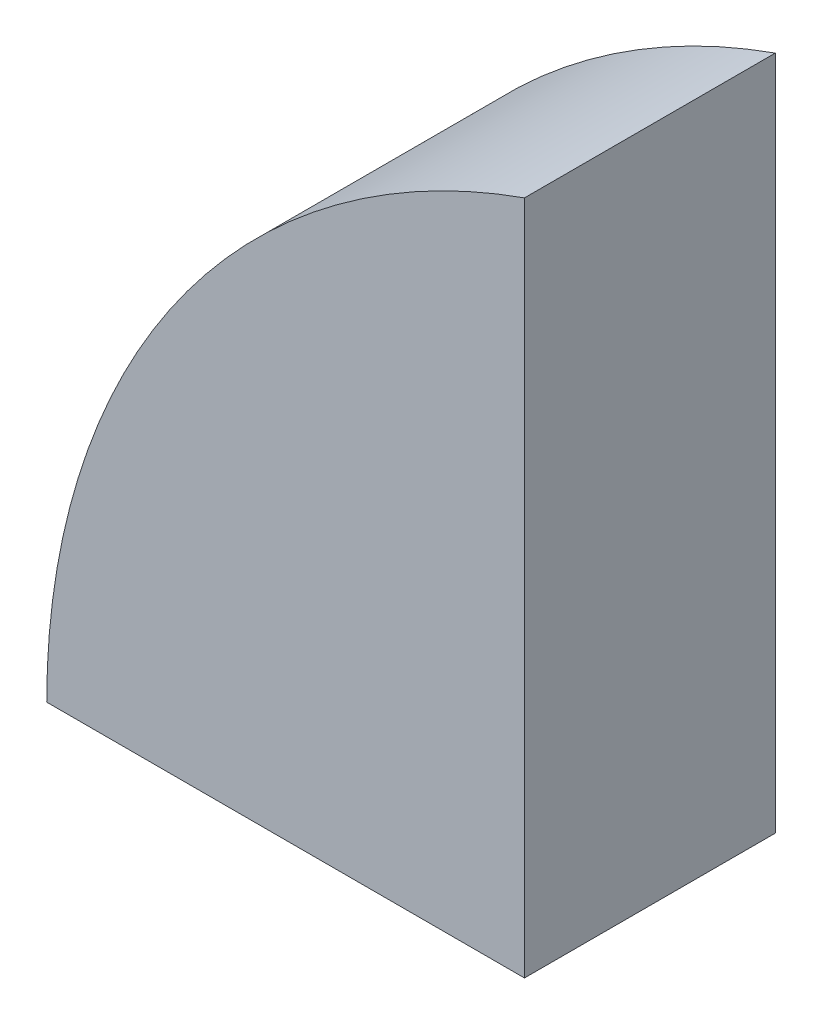
ISO-10303-21;
HEADER;
FILE_DESCRIPTION(('STEP AP214'),'2;1');
FILE_NAME('part.step','',(''),(''),'','','');
FILE_SCHEMA(('AUTOMOTIVE_DESIGN { 1 0 10303 214 1 1 1 1 }'));
ENDSEC;
DATA;
#1=APPLICATION_CONTEXT('core data for automotive mechanical design processes');
#2=APPLICATION_PROTOCOL_DEFINITION('international standard','automotive_design',2000,#1);
#3=PRODUCT_CONTEXT('',#1,'mechanical');
#4=PRODUCT('Part','Part','',(#3));
#5=PRODUCT_RELATED_PRODUCT_CATEGORY('part','',(#4));
#6=PRODUCT_DEFINITION_FORMATION('','',#4);
#7=PRODUCT_DEFINITION_CONTEXT('part definition',#1,'design');
#8=PRODUCT_DEFINITION('design','',#6,#7);
#9=PRODUCT_DEFINITION_SHAPE('','',#8);
#10=(LENGTH_UNIT() NAMED_UNIT(*) SI_UNIT(.MILLI.,.METRE.));
#11=(NAMED_UNIT(*) PLANE_ANGLE_UNIT() SI_UNIT($,.RADIAN.));
#12=(NAMED_UNIT(*) SI_UNIT($,.STERADIAN.) SOLID_ANGLE_UNIT());
#13=UNCERTAINTY_MEASURE_WITH_UNIT(LENGTH_MEASURE(1.E-05),#10,'distance_accuracy_value','');
#14=(GEOMETRIC_REPRESENTATION_CONTEXT(3) GLOBAL_UNCERTAINTY_ASSIGNED_CONTEXT((#13)) GLOBAL_UNIT_ASSIGNED_CONTEXT((#10,
#11,#12)) REPRESENTATION_CONTEXT('',''));
#15=CARTESIAN_POINT('',(0.,0.,0.));
#16=DIRECTION('',(0.,0.,1.));
#17=DIRECTION('',(1.,0.,0.));
#18=AXIS2_PLACEMENT_3D('',#15,#16,#17);
#19=CARTESIAN_POINT('',(75.116991160668,-169.122807017544,70.));
#20=DIRECTION('',(0.,0.,-1.));
#21=DIRECTION('',(-1.,0.,0.));
#22=AXIS2_PLACEMENT_3D('',#19,#20,#21);
#23=CYLINDRICAL_SURFACE('',#22,200.);
#24=CARTESIAN_POINT('',(75.116991160668,-169.122807017544,0.));
#25=DIRECTION('',(0.,0.,1.));
#26=DIRECTION('',(1.,0.,0.));
#27=AXIS2_PLACEMENT_3D('',#24,#25,#26);
#28=CIRCLE('',#27,200.);
#29=CARTESIAN_POINT('',(8.45032449400135,19.4390012988688,0.));
#30=VERTEX_POINT('',#29);
#31=CARTESIAN_POINT('',(-124.883008839332,-169.122807017544,0.));
#32=VERTEX_POINT('',#31);
#33=EDGE_CURVE('E80',#30,#32,#28,.T.);
#34=ORIENTED_EDGE('',*,*,#33,.T.);
#35=DIRECTION('',(0.,0.,-1.));
#36=VECTOR('',#35,1.);
#37=CARTESIAN_POINT('',(-124.883008839332,-169.122807017544,70.));
#38=LINE('',#37,#36);
#39=CARTESIAN_POINT('',(-124.883008839332,-169.122807017544,70.));
#40=VERTEX_POINT('',#39);
#41=EDGE_CURVE('E11',#40,#32,#38,.T.);
#42=ORIENTED_EDGE('',*,*,#41,.F.);
#43=CARTESIAN_POINT('',(75.116991160668,-169.122807017544,70.));
#44=DIRECTION('',(0.,0.,1.));
#45=DIRECTION('',(1.,0.,0.));
#46=AXIS2_PLACEMENT_3D('',#43,#44,#45);
#47=CIRCLE('',#46,200.);
#48=CARTESIAN_POINT('',(8.45032449400135,19.4390012988688,70.));
#49=VERTEX_POINT('',#48);
#50=EDGE_CURVE('E73',#49,#40,#47,.T.);
#51=ORIENTED_EDGE('',*,*,#50,.F.);
#52=DIRECTION('',(0.,0.,-1.));
#53=VECTOR('',#52,1.);
#54=CARTESIAN_POINT('',(8.45032449400135,19.4390012988688,70.));
#55=LINE('',#54,#53);
#56=EDGE_CURVE('E81',#49,#30,#55,.T.);
#57=ORIENTED_EDGE('',*,*,#56,.T.);
#58=EDGE_LOOP('',(#34,#42,#51,#57));
#59=FACE_BOUND('',#58,.T.);
#60=ADVANCED_FACE('F33',(#59),#23,.T.);
#61=CARTESIAN_POINT('',(-124.883008839332,-169.122807017544,70.));
#62=DIRECTION('',(0.,1.,0.));
#63=DIRECTION('',(0.,0.,1.));
#64=AXIS2_PLACEMENT_3D('',#61,#62,#63);
#65=PLANE('',#64);
#66=DIRECTION('',(1.,0.,0.));
#67=VECTOR('',#66,1.);
#68=CARTESIAN_POINT('',(-124.883008839332,-169.122807017544,0.));
#69=LINE('',#68,#67);
#70=CARTESIAN_POINT('',(8.45032449400135,-169.122807017544,0.));
#71=VERTEX_POINT('',#70);
#72=EDGE_CURVE('E61',#32,#71,#69,.T.);
#73=ORIENTED_EDGE('',*,*,#72,.T.);
#74=DIRECTION('',(0.,0.,-1.));
#75=VECTOR('',#74,1.);
#76=CARTESIAN_POINT('',(8.45032449400135,-169.122807017544,70.));
#77=LINE('',#76,#75);
#78=CARTESIAN_POINT('',(8.45032449400135,-169.122807017544,70.));
#79=VERTEX_POINT('',#78);
#80=EDGE_CURVE('E41',#79,#71,#77,.T.);
#81=ORIENTED_EDGE('',*,*,#80,.F.);
#82=DIRECTION('',(1.,0.,0.));
#83=VECTOR('',#82,1.);
#84=CARTESIAN_POINT('',(-124.883008839332,-169.122807017544,70.));
#85=LINE('',#84,#83);
#86=EDGE_CURVE('E69',#40,#79,#85,.T.);
#87=ORIENTED_EDGE('',*,*,#86,.F.);
#88=ORIENTED_EDGE('',*,*,#41,.T.);
#89=EDGE_LOOP('',(#73,#81,#87,#88));
#90=FACE_BOUND('',#89,.T.);
#91=ADVANCED_FACE('F70',(#90),#65,.F.);
#92=CARTESIAN_POINT('',(8.45032449400135,-169.122807017544,70.));
#93=DIRECTION('',(-1.,0.,0.));
#94=DIRECTION('',(0.,0.,1.));
#95=AXIS2_PLACEMENT_3D('',#92,#93,#94);
#96=PLANE('',#95);
#97=DIRECTION('',(0.,1.,0.));
#98=VECTOR('',#97,1.);
#99=CARTESIAN_POINT('',(8.45032449400135,-169.122807017544,0.));
#100=LINE('',#99,#98);
#101=EDGE_CURVE('E66',#71,#30,#100,.T.);
#102=ORIENTED_EDGE('',*,*,#101,.T.);
#103=ORIENTED_EDGE('',*,*,#56,.F.);
#104=DIRECTION('',(0.,1.,0.));
#105=VECTOR('',#104,1.);
#106=CARTESIAN_POINT('',(8.45032449400135,-169.122807017544,70.));
#107=LINE('',#106,#105);
#108=EDGE_CURVE('E49',#79,#49,#107,.T.);
#109=ORIENTED_EDGE('',*,*,#108,.F.);
#110=ORIENTED_EDGE('',*,*,#80,.T.);
#111=EDGE_LOOP('',(#102,#103,#109,#110));
#112=FACE_BOUND('',#111,.T.);
#113=ADVANCED_FACE('F88',(#112),#96,.F.);
#114=CARTESIAN_POINT('',(75.116991160668,-169.122807017544,70.));
#115=DIRECTION('',(0.,0.,1.));
#116=DIRECTION('',(1.,0.,0.));
#117=AXIS2_PLACEMENT_3D('',#114,#115,#116);
#118=PLANE('',#117);
#119=ORIENTED_EDGE('',*,*,#50,.T.);
#120=ORIENTED_EDGE('',*,*,#86,.T.);
#121=ORIENTED_EDGE('',*,*,#108,.T.);
#122=EDGE_LOOP('',(#119,#120,#121));
#123=FACE_BOUND('',#122,.T.);
#124=ADVANCED_FACE('F76',(#123),#118,.T.);
#125=CARTESIAN_POINT('',(75.116991160668,-169.122807017544,0.));
#126=DIRECTION('',(0.,0.,1.));
#127=DIRECTION('',(1.,0.,0.));
#128=AXIS2_PLACEMENT_3D('',#125,#126,#127);
#129=PLANE('',#128);
#130=ORIENTED_EDGE('',*,*,#33,.F.);
#131=ORIENTED_EDGE('',*,*,#101,.F.);
#132=ORIENTED_EDGE('',*,*,#72,.F.);
#133=EDGE_LOOP('',(#130,#131,#132));
#134=FACE_BOUND('',#133,.T.);
#135=ADVANCED_FACE('F89',(#134),#129,.F.);
#136=CLOSED_SHELL('',(#60,#91,#113,#124,#135));
#137=MANIFOLD_SOLID_BREP('B2',#136);
#138=ADVANCED_BREP_SHAPE_REPRESENTATION('',(#18,#137),#14);
#139=SHAPE_DEFINITION_REPRESENTATION(#9,#138);
ENDSEC;
END-ISO-10303-21;
